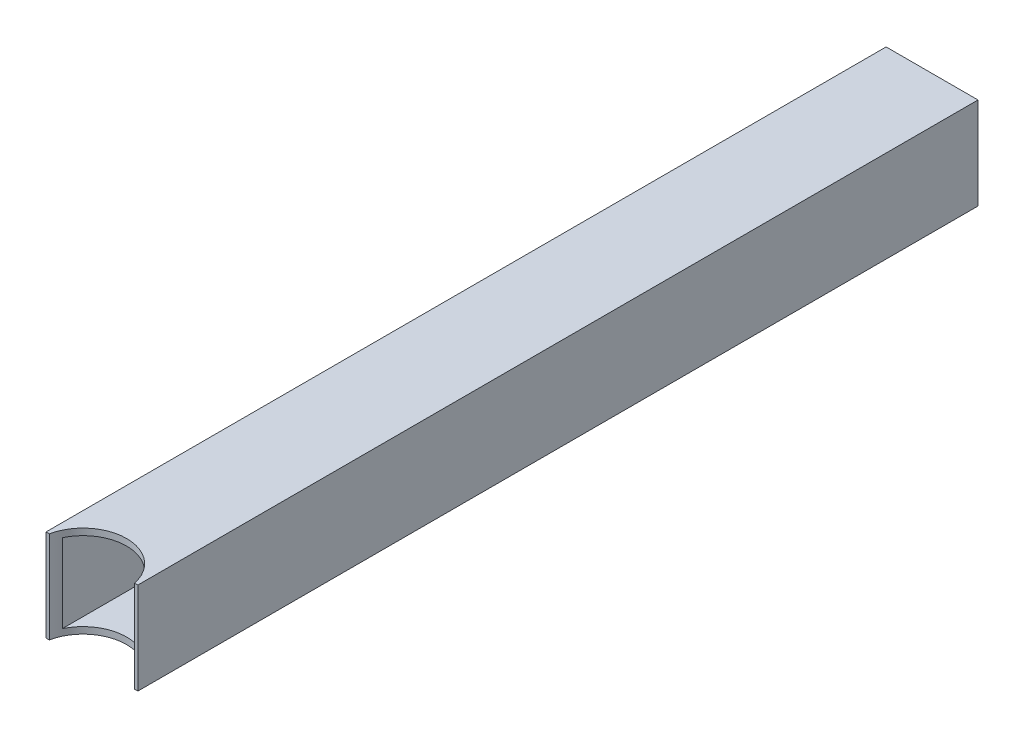
ISO-10303-21;
HEADER;
FILE_DESCRIPTION(('STEP AP214'),'2;1');
FILE_NAME('part.step','',(''),(''),'','','');
FILE_SCHEMA(('AUTOMOTIVE_DESIGN { 1 0 10303 214 1 1 1 1 }'));
ENDSEC;
DATA;
#1=APPLICATION_CONTEXT('core data for automotive mechanical design processes');
#2=APPLICATION_PROTOCOL_DEFINITION('international standard','automotive_design',2000,#1);
#3=PRODUCT_CONTEXT('',#1,'mechanical');
#4=PRODUCT('Part','Part','',(#3));
#5=PRODUCT_RELATED_PRODUCT_CATEGORY('part','',(#4));
#6=PRODUCT_DEFINITION_FORMATION('','',#4);
#7=PRODUCT_DEFINITION_CONTEXT('part definition',#1,'design');
#8=PRODUCT_DEFINITION('design','',#6,#7);
#9=PRODUCT_DEFINITION_SHAPE('','',#8);
#10=(LENGTH_UNIT() NAMED_UNIT(*) SI_UNIT(.MILLI.,.METRE.));
#11=(NAMED_UNIT(*) PLANE_ANGLE_UNIT() SI_UNIT($,.RADIAN.));
#12=(NAMED_UNIT(*) SI_UNIT($,.STERADIAN.) SOLID_ANGLE_UNIT());
#13=UNCERTAINTY_MEASURE_WITH_UNIT(LENGTH_MEASURE(1.E-05),#10,'distance_accuracy_value','');
#14=(GEOMETRIC_REPRESENTATION_CONTEXT(3) GLOBAL_UNCERTAINTY_ASSIGNED_CONTEXT((#13)) GLOBAL_UNIT_ASSIGNED_CONTEXT((#10,
#11,#12)) REPRESENTATION_CONTEXT('',''));
#15=CARTESIAN_POINT('',(0.,0.,0.));
#16=DIRECTION('',(0.,0.,1.));
#17=DIRECTION('',(1.,0.,0.));
#18=AXIS2_PLACEMENT_3D('',#15,#16,#17);
#19=CARTESIAN_POINT('',(682.625,0.,450.85));
#20=DIRECTION('',(0.,0.,1.));
#21=DIRECTION('',(1.,0.,0.));
#22=AXIS2_PLACEMENT_3D('',#19,#20,#21);
#23=PLANE('',#22);
#24=DIRECTION('',(0.,1.,0.));
#25=VECTOR('',#24,1.);
#26=CARTESIAN_POINT('',(660.4,0.,450.85));
#27=LINE('',#26,#25);
#28=CARTESIAN_POINT('',(660.4,-793.75,450.85));
#29=VERTEX_POINT('',#28);
#30=CARTESIAN_POINT('',(660.4,-838.2,450.85));
#31=VERTEX_POINT('',#30);
#32=EDGE_CURVE('E137',#29,#31,#27,.F.);
#33=ORIENTED_EDGE('',*,*,#32,.T.);
#34=DIRECTION('',(1.,0.,0.));
#35=VECTOR('',#34,1.);
#36=CARTESIAN_POINT('',(682.625,-838.2,450.85));
#37=LINE('',#36,#35);
#38=CARTESIAN_POINT('',(661.989942452225,-838.2,450.85));
#39=VERTEX_POINT('',#38);
#40=EDGE_CURVE('E146',#31,#39,#37,.T.);
#41=ORIENTED_EDGE('',*,*,#40,.T.);
#42=DIRECTION('',(0.,1.,0.));
#43=VECTOR('',#42,1.);
#44=CARTESIAN_POINT('',(661.989942452225,-793.748,450.85));
#45=LINE('',#44,#43);
#46=CARTESIAN_POINT('',(661.989942452225,-793.75,450.85));
#47=VERTEX_POINT('',#46);
#48=EDGE_CURVE('E143',#39,#47,#45,.T.);
#49=ORIENTED_EDGE('',*,*,#48,.T.);
#50=DIRECTION('',(1.,0.,0.));
#51=VECTOR('',#50,1.);
#52=CARTESIAN_POINT('',(682.625,-793.75,450.85));
#53=LINE('',#52,#51);
#54=EDGE_CURVE('E160',#47,#29,#53,.F.);
#55=ORIENTED_EDGE('',*,*,#54,.T.);
#56=EDGE_LOOP('',(#33,#41,#49,#55));
#57=FACE_BOUND('',#56,.T.);
#58=ADVANCED_FACE('F16',(#57),#23,.T.);
#59=CARTESIAN_POINT('',(682.625,-835.025,450.85));
#60=DIRECTION('',(0.,-1.,0.));
#61=DIRECTION('',(0.,0.,-1.));
#62=AXIS2_PLACEMENT_3D('',#59,#60,#61);
#63=PLANE('',#62);
#64=CARTESIAN_POINT('',(682.625,-835.025,455.168));
#65=DIRECTION('',(0.,1.,0.));
#66=DIRECTION('',(0.,0.,1.));
#67=AXIS2_PLACEMENT_3D('',#64,#65,#66);
#68=CIRCLE('',#67,21.082);
#69=CARTESIAN_POINT('',(663.575,-835.025,446.137594472007));
#70=VERTEX_POINT('',#69);
#71=CARTESIAN_POINT('',(701.675,-835.025,446.137594472008));
#72=VERTEX_POINT('',#71);
#73=EDGE_CURVE('E130',#70,#72,#68,.F.);
#74=ORIENTED_EDGE('',*,*,#73,.T.);
#75=DIRECTION('',(0.,0.,1.));
#76=VECTOR('',#75,1.);
#77=CARTESIAN_POINT('',(701.675,-835.025,450.85));
#78=LINE('',#77,#76);
#79=CARTESIAN_POINT('',(701.675,-835.025,44.45));
#80=VERTEX_POINT('',#79);
#81=EDGE_CURVE('E149',#72,#80,#78,.F.);
#82=ORIENTED_EDGE('',*,*,#81,.T.);
#83=DIRECTION('',(1.,0.,0.));
#84=VECTOR('',#83,1.);
#85=CARTESIAN_POINT('',(682.625,-835.025,44.45));
#86=LINE('',#85,#84);
#87=CARTESIAN_POINT('',(663.575,-835.025,44.45));
#88=VERTEX_POINT('',#87);
#89=EDGE_CURVE('E175',#80,#88,#86,.F.);
#90=ORIENTED_EDGE('',*,*,#89,.T.);
#91=DIRECTION('',(0.,0.,1.));
#92=VECTOR('',#91,1.);
#93=CARTESIAN_POINT('',(663.575,-835.025,450.85));
#94=LINE('',#93,#92);
#95=EDGE_CURVE('E119',#70,#88,#94,.F.);
#96=ORIENTED_EDGE('',*,*,#95,.F.);
#97=EDGE_LOOP('',(#74,#82,#90,#96));
#98=FACE_BOUND('',#97,.T.);
#99=ADVANCED_FACE('F319',(#98),#63,.F.);
#100=CARTESIAN_POINT('',(663.575,0.,450.85));
#101=DIRECTION('',(1.,0.,0.));
#102=DIRECTION('',(0.,1.,0.));
#103=AXIS2_PLACEMENT_3D('',#100,#101,#102);
#104=PLANE('',#103);
#105=DIRECTION('',(0.,1.,0.));
#106=VECTOR('',#105,1.);
#107=CARTESIAN_POINT('',(663.575,0.,44.45));
#108=LINE('',#107,#106);
#109=CARTESIAN_POINT('',(663.575,-796.925,44.45));
#110=VERTEX_POINT('',#109);
#111=EDGE_CURVE('E116',#88,#110,#108,.T.);
#112=ORIENTED_EDGE('',*,*,#111,.T.);
#113=DIRECTION('',(0.,0.,1.));
#114=VECTOR('',#113,1.);
#115=CARTESIAN_POINT('',(663.575,-796.925,450.85));
#116=LINE('',#115,#114);
#117=CARTESIAN_POINT('',(663.575,-796.925,446.137594472008));
#118=VERTEX_POINT('',#117);
#119=EDGE_CURVE('E109',#118,#110,#116,.F.);
#120=ORIENTED_EDGE('',*,*,#119,.F.);
#121=DIRECTION('',(0.,1.,0.));
#122=VECTOR('',#121,1.);
#123=CARTESIAN_POINT('',(663.575,-793.748,446.137594472008));
#124=LINE('',#123,#122);
#125=EDGE_CURVE('E113',#118,#70,#124,.F.);
#126=ORIENTED_EDGE('',*,*,#125,.T.);
#127=ORIENTED_EDGE('',*,*,#95,.T.);
#128=EDGE_LOOP('',(#112,#120,#126,#127));
#129=FACE_BOUND('',#128,.T.);
#130=ADVANCED_FACE('F110',(#129),#104,.T.);
#131=CARTESIAN_POINT('',(663.575,-796.925,450.85));
#132=DIRECTION('',(0.,-1.,0.));
#133=DIRECTION('',(1.,0.,0.));
#134=AXIS2_PLACEMENT_3D('',#131,#132,#133);
#135=PLANE('',#134);
#136=DIRECTION('',(1.,0.,0.));
#137=VECTOR('',#136,1.);
#138=CARTESIAN_POINT('',(682.625,-796.925,44.45));
#139=LINE('',#138,#137);
#140=CARTESIAN_POINT('',(701.675,-796.925,44.45));
#141=VERTEX_POINT('',#140);
#142=EDGE_CURVE('E172',#110,#141,#139,.T.);
#143=ORIENTED_EDGE('',*,*,#142,.T.);
#144=DIRECTION('',(0.,0.,1.));
#145=VECTOR('',#144,1.);
#146=CARTESIAN_POINT('',(701.675,-796.925,450.85));
#147=LINE('',#146,#145);
#148=CARTESIAN_POINT('',(701.675,-796.925,446.137594472008));
#149=VERTEX_POINT('',#148);
#150=EDGE_CURVE('E102',#141,#149,#147,.T.);
#151=ORIENTED_EDGE('',*,*,#150,.T.);
#152=CARTESIAN_POINT('',(682.625,-796.925,455.168));
#153=DIRECTION('',(0.,1.,0.));
#154=DIRECTION('',(0.,0.,1.));
#155=AXIS2_PLACEMENT_3D('',#152,#153,#154);
#156=CIRCLE('',#155,21.082);
#157=EDGE_CURVE('E19',#149,#118,#156,.T.);
#158=ORIENTED_EDGE('',*,*,#157,.T.);
#159=ORIENTED_EDGE('',*,*,#119,.T.);
#160=EDGE_LOOP('',(#143,#151,#158,#159));
#161=FACE_BOUND('',#160,.T.);
#162=ADVANCED_FACE('F122',(#161),#135,.T.);
#163=CARTESIAN_POINT('',(701.675,0.,450.85));
#164=DIRECTION('',(1.,0.,0.));
#165=DIRECTION('',(0.,1.,0.));
#166=AXIS2_PLACEMENT_3D('',#163,#164,#165);
#167=PLANE('',#166);
#168=DIRECTION('',(0.,1.,0.));
#169=VECTOR('',#168,1.);
#170=CARTESIAN_POINT('',(701.675,-793.748,446.137594472008));
#171=LINE('',#170,#169);
#172=EDGE_CURVE('E126',#72,#149,#171,.T.);
#173=ORIENTED_EDGE('',*,*,#172,.T.);
#174=ORIENTED_EDGE('',*,*,#150,.F.);
#175=DIRECTION('',(0.,1.,0.));
#176=VECTOR('',#175,1.);
#177=CARTESIAN_POINT('',(701.675,0.,44.45));
#178=LINE('',#177,#176);
#179=EDGE_CURVE('E167',#141,#80,#178,.F.);
#180=ORIENTED_EDGE('',*,*,#179,.T.);
#181=ORIENTED_EDGE('',*,*,#81,.F.);
#182=EDGE_LOOP('',(#173,#174,#180,#181));
#183=FACE_BOUND('',#182,.T.);
#184=ADVANCED_FACE('F345',(#183),#167,.F.);
#185=CARTESIAN_POINT('',(682.625,-793.748,455.168));
#186=DIRECTION('',(0.,1.,0.));
#187=DIRECTION('',(0.,0.,1.));
#188=AXIS2_PLACEMENT_3D('',#185,#186,#187);
#189=CYLINDRICAL_SURFACE('',#188,21.082);
#190=ORIENTED_EDGE('',*,*,#125,.F.);
#191=ORIENTED_EDGE('',*,*,#157,.F.);
#192=ORIENTED_EDGE('',*,*,#172,.F.);
#193=ORIENTED_EDGE('',*,*,#73,.F.);
#194=EDGE_LOOP('',(#190,#191,#192,#193));
#195=FACE_BOUND('',#194,.T.);
#196=CARTESIAN_POINT('',(682.625,-838.2,455.168));
#197=DIRECTION('',(0.,1.,0.));
#198=DIRECTION('',(0.,0.,1.));
#199=AXIS2_PLACEMENT_3D('',#196,#197,#198);
#200=CIRCLE('',#199,21.082);
#201=CARTESIAN_POINT('',(703.260057547776,-838.2,450.85));
#202=VERTEX_POINT('',#201);
#203=EDGE_CURVE('E199',#202,#39,#200,.T.);
#204=ORIENTED_EDGE('',*,*,#203,.F.);
#205=DIRECTION('',(0.,1.,0.));
#206=VECTOR('',#205,1.);
#207=CARTESIAN_POINT('',(703.260057547776,0.,450.85));
#208=LINE('',#207,#206);
#209=CARTESIAN_POINT('',(703.260057547776,-793.75,450.85));
#210=VERTEX_POINT('',#209);
#211=EDGE_CURVE('E214',#210,#202,#208,.F.);
#212=ORIENTED_EDGE('',*,*,#211,.F.);
#213=CARTESIAN_POINT('',(682.625,-793.75,455.168));
#214=DIRECTION('',(0.,1.,0.));
#215=DIRECTION('',(0.,0.,1.));
#216=AXIS2_PLACEMENT_3D('',#213,#214,#215);
#217=CIRCLE('',#216,21.082);
#218=EDGE_CURVE('E211',#210,#47,#217,.T.);
#219=ORIENTED_EDGE('',*,*,#218,.T.);
#220=ORIENTED_EDGE('',*,*,#48,.F.);
#221=EDGE_LOOP('',(#204,#212,#219,#220));
#222=FACE_BOUND('',#221,.T.);
#223=ADVANCED_FACE('F127',(#195,#222),#189,.F.);
#224=CARTESIAN_POINT('',(660.4,0.,450.85));
#225=DIRECTION('',(1.,0.,0.));
#226=DIRECTION('',(0.,1.,0.));
#227=AXIS2_PLACEMENT_3D('',#224,#225,#226);
#228=PLANE('',#227);
#229=DIRECTION('',(0.,0.,-1.));
#230=VECTOR('',#229,1.);
#231=CARTESIAN_POINT('',(660.4,-838.2,450.85));
#232=LINE('',#231,#230);
#233=CARTESIAN_POINT('',(660.4,-838.2,44.45));
#234=VERTEX_POINT('',#233);
#235=EDGE_CURVE('E194',#31,#234,#232,.T.);
#236=ORIENTED_EDGE('',*,*,#235,.F.);
#237=ORIENTED_EDGE('',*,*,#32,.F.);
#238=DIRECTION('',(0.,0.,1.));
#239=VECTOR('',#238,1.);
#240=CARTESIAN_POINT('',(660.4,-793.75,450.85));
#241=LINE('',#240,#239);
#242=CARTESIAN_POINT('',(660.4,-793.75,44.45));
#243=VERTEX_POINT('',#242);
#244=EDGE_CURVE('E171',#29,#243,#241,.F.);
#245=ORIENTED_EDGE('',*,*,#244,.T.);
#246=DIRECTION('',(0.,1.,0.));
#247=VECTOR('',#246,1.);
#248=CARTESIAN_POINT('',(660.4,0.,44.45));
#249=LINE('',#248,#247);
#250=EDGE_CURVE('E178',#243,#234,#249,.F.);
#251=ORIENTED_EDGE('',*,*,#250,.T.);
#252=EDGE_LOOP('',(#236,#237,#245,#251));
#253=FACE_BOUND('',#252,.T.);
#254=ADVANCED_FACE('F277',(#253),#228,.F.);
#255=CARTESIAN_POINT('',(682.625,0.,44.45));
#256=DIRECTION('',(0.,0.,1.));
#257=DIRECTION('',(1.,0.,0.));
#258=AXIS2_PLACEMENT_3D('',#255,#256,#257);
#259=PLANE('',#258);
#260=ORIENTED_EDGE('',*,*,#142,.F.);
#261=ORIENTED_EDGE('',*,*,#111,.F.);
#262=ORIENTED_EDGE('',*,*,#89,.F.);
#263=ORIENTED_EDGE('',*,*,#179,.F.);
#264=EDGE_LOOP('',(#260,#261,#262,#263));
#265=FACE_BOUND('',#264,.T.);
#266=DIRECTION('',(1.,0.,0.));
#267=VECTOR('',#266,1.);
#268=CARTESIAN_POINT('',(682.625,-838.2,44.45));
#269=LINE('',#268,#267);
#270=CARTESIAN_POINT('',(704.85,-838.2,44.45));
#271=VERTEX_POINT('',#270);
#272=EDGE_CURVE('E198',#234,#271,#269,.T.);
#273=ORIENTED_EDGE('',*,*,#272,.F.);
#274=ORIENTED_EDGE('',*,*,#250,.F.);
#275=DIRECTION('',(1.,0.,0.));
#276=VECTOR('',#275,1.);
#277=CARTESIAN_POINT('',(663.575,-793.75,44.45));
#278=LINE('',#277,#276);
#279=CARTESIAN_POINT('',(704.85,-793.75,44.45));
#280=VERTEX_POINT('',#279);
#281=EDGE_CURVE('E205',#243,#280,#278,.T.);
#282=ORIENTED_EDGE('',*,*,#281,.T.);
#283=DIRECTION('',(0.,1.,0.));
#284=VECTOR('',#283,1.);
#285=CARTESIAN_POINT('',(704.85,0.,44.45));
#286=LINE('',#285,#284);
#287=EDGE_CURVE('E252',#271,#280,#286,.T.);
#288=ORIENTED_EDGE('',*,*,#287,.F.);
#289=EDGE_LOOP('',(#273,#274,#282,#288));
#290=FACE_BOUND('',#289,.T.);
#291=ADVANCED_FACE('F279',(#265,#290),#259,.F.);
#292=CARTESIAN_POINT('',(663.575,-793.75,450.85));
#293=DIRECTION('',(0.,-1.,0.));
#294=DIRECTION('',(1.,0.,0.));
#295=AXIS2_PLACEMENT_3D('',#292,#293,#294);
#296=PLANE('',#295);
#297=DIRECTION('',(1.,0.,0.));
#298=VECTOR('',#297,1.);
#299=CARTESIAN_POINT('',(682.625,-793.75,450.85));
#300=LINE('',#299,#298);
#301=CARTESIAN_POINT('',(704.85,-793.75,450.85));
#302=VERTEX_POINT('',#301);
#303=EDGE_CURVE('E210',#302,#210,#300,.F.);
#304=ORIENTED_EDGE('',*,*,#303,.F.);
#305=DIRECTION('',(0.,0.,1.));
#306=VECTOR('',#305,1.);
#307=CARTESIAN_POINT('',(704.85,-793.75,450.85));
#308=LINE('',#307,#306);
#309=EDGE_CURVE('E239',#280,#302,#308,.T.);
#310=ORIENTED_EDGE('',*,*,#309,.F.);
#311=ORIENTED_EDGE('',*,*,#281,.F.);
#312=ORIENTED_EDGE('',*,*,#244,.F.);
#313=ORIENTED_EDGE('',*,*,#54,.F.);
#314=ORIENTED_EDGE('',*,*,#218,.F.);
#315=EDGE_LOOP('',(#304,#310,#311,#312,#313,#314));
#316=FACE_BOUND('',#315,.T.);
#317=ADVANCED_FACE('F272',(#316),#296,.F.);
#318=CARTESIAN_POINT('',(682.625,0.,450.85));
#319=DIRECTION('',(0.,0.,1.));
#320=DIRECTION('',(1.,0.,0.));
#321=AXIS2_PLACEMENT_3D('',#318,#319,#320);
#322=PLANE('',#321);
#323=DIRECTION('',(0.,1.,0.));
#324=VECTOR('',#323,1.);
#325=CARTESIAN_POINT('',(704.85,0.,450.85));
#326=LINE('',#325,#324);
#327=CARTESIAN_POINT('',(704.85,-838.2,450.85));
#328=VERTEX_POINT('',#327);
#329=EDGE_CURVE('E26',#302,#328,#326,.F.);
#330=ORIENTED_EDGE('',*,*,#329,.F.);
#331=ORIENTED_EDGE('',*,*,#303,.T.);
#332=ORIENTED_EDGE('',*,*,#211,.T.);
#333=DIRECTION('',(1.,0.,0.));
#334=VECTOR('',#333,1.);
#335=CARTESIAN_POINT('',(682.625,-838.2,450.85));
#336=LINE('',#335,#334);
#337=EDGE_CURVE('E39',#328,#202,#336,.F.);
#338=ORIENTED_EDGE('',*,*,#337,.F.);
#339=EDGE_LOOP('',(#330,#331,#332,#338));
#340=FACE_BOUND('',#339,.T.);
#341=ADVANCED_FACE('F270',(#340),#322,.T.);
#342=CARTESIAN_POINT('',(682.625,-838.2,450.85));
#343=DIRECTION('',(0.,-1.,0.));
#344=DIRECTION('',(0.,0.,-1.));
#345=AXIS2_PLACEMENT_3D('',#342,#343,#344);
#346=PLANE('',#345);
#347=DIRECTION('',(0.,0.,1.));
#348=VECTOR('',#347,1.);
#349=CARTESIAN_POINT('',(704.85,-838.2,450.85));
#350=LINE('',#349,#348);
#351=EDGE_CURVE('E11',#328,#271,#350,.F.);
#352=ORIENTED_EDGE('',*,*,#351,.F.);
#353=ORIENTED_EDGE('',*,*,#337,.T.);
#354=ORIENTED_EDGE('',*,*,#203,.T.);
#355=ORIENTED_EDGE('',*,*,#40,.F.);
#356=ORIENTED_EDGE('',*,*,#235,.T.);
#357=ORIENTED_EDGE('',*,*,#272,.T.);
#358=EDGE_LOOP('',(#352,#353,#354,#355,#356,#357));
#359=FACE_BOUND('',#358,.T.);
#360=ADVANCED_FACE('F265',(#359),#346,.T.);
#361=CARTESIAN_POINT('',(704.85,0.,450.85));
#362=DIRECTION('',(1.,0.,0.));
#363=DIRECTION('',(0.,1.,0.));
#364=AXIS2_PLACEMENT_3D('',#361,#362,#363);
#365=PLANE('',#364);
#366=ORIENTED_EDGE('',*,*,#329,.T.);
#367=ORIENTED_EDGE('',*,*,#351,.T.);
#368=ORIENTED_EDGE('',*,*,#287,.T.);
#369=ORIENTED_EDGE('',*,*,#309,.T.);
#370=EDGE_LOOP('',(#366,#367,#368,#369));
#371=FACE_BOUND('',#370,.T.);
#372=ADVANCED_FACE('F269',(#371),#365,.T.);
#373=CLOSED_SHELL('',(#58,#99,#130,#162,#184,#223,#254,#291,#317,#341,#360,#372));
#374=MANIFOLD_SOLID_BREP('B1',#373);
#375=ADVANCED_BREP_SHAPE_REPRESENTATION('',(#18,#374),#14);
#376=SHAPE_DEFINITION_REPRESENTATION(#9,#375);
ENDSEC;
END-ISO-10303-21;
